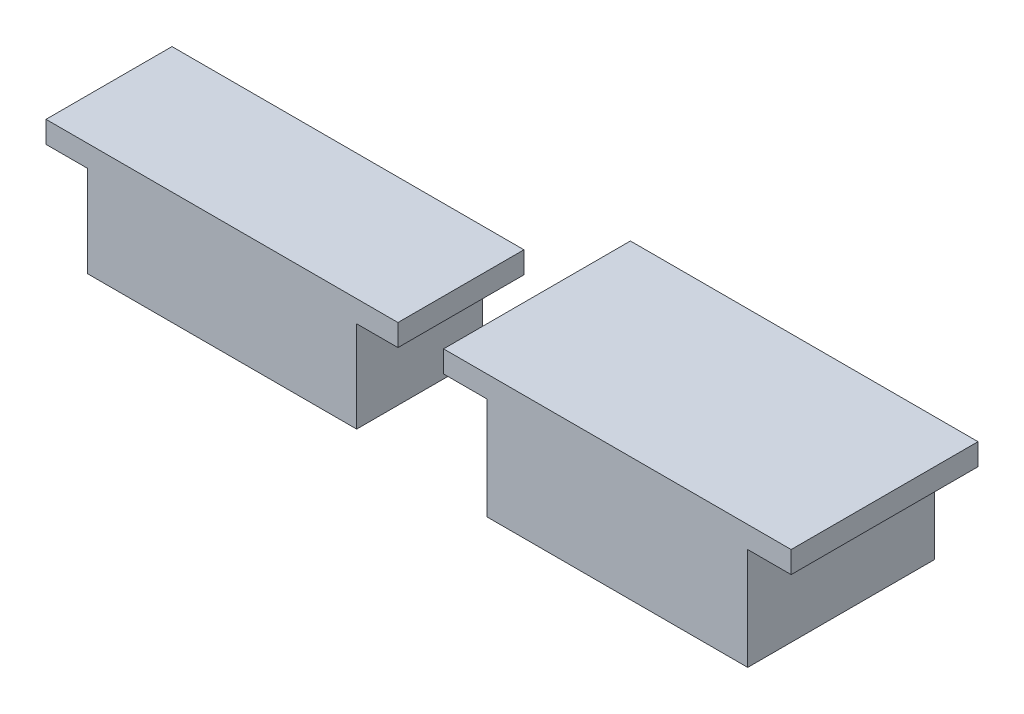
ISO-10303-21;
HEADER;
FILE_DESCRIPTION(('STEP AP214'),'2;1');
FILE_NAME('part.step','',(''),(''),'','','');
FILE_SCHEMA(('AUTOMOTIVE_DESIGN { 1 0 10303 214 1 1 1 1 }'));
ENDSEC;
DATA;
#1=APPLICATION_CONTEXT('core data for automotive mechanical design processes');
#2=APPLICATION_PROTOCOL_DEFINITION('international standard','automotive_design',2000,#1);
#3=PRODUCT_CONTEXT('',#1,'mechanical');
#4=PRODUCT('Part','Part','',(#3));
#5=PRODUCT_RELATED_PRODUCT_CATEGORY('part','',(#4));
#6=PRODUCT_DEFINITION_FORMATION('','',#4);
#7=PRODUCT_DEFINITION_CONTEXT('part definition',#1,'design');
#8=PRODUCT_DEFINITION('design','',#6,#7);
#9=PRODUCT_DEFINITION_SHAPE('','',#8);
#10=(LENGTH_UNIT() NAMED_UNIT(*) SI_UNIT(.MILLI.,.METRE.));
#11=(NAMED_UNIT(*) PLANE_ANGLE_UNIT() SI_UNIT($,.RADIAN.));
#12=(NAMED_UNIT(*) SI_UNIT($,.STERADIAN.) SOLID_ANGLE_UNIT());
#13=UNCERTAINTY_MEASURE_WITH_UNIT(LENGTH_MEASURE(1.E-05),#10,'distance_accuracy_value','');
#14=(GEOMETRIC_REPRESENTATION_CONTEXT(3) GLOBAL_UNCERTAINTY_ASSIGNED_CONTEXT((#13)) GLOBAL_UNIT_ASSIGNED_CONTEXT((#10,
#11,#12)) REPRESENTATION_CONTEXT('',''));
#15=CARTESIAN_POINT('',(0.,0.,0.));
#16=DIRECTION('',(0.,0.,1.));
#17=DIRECTION('',(1.,0.,0.));
#18=AXIS2_PLACEMENT_3D('',#15,#16,#17);
#19=CARTESIAN_POINT('',(-144.,-7.,-34.5));
#20=DIRECTION('',(0.,-1.,0.));
#21=DIRECTION('',(-1.,0.,0.));
#22=AXIS2_PLACEMENT_3D('',#19,#20,#21);
#23=PLANE('',#22);
#24=DIRECTION('',(0.,0.,1.));
#25=VECTOR('',#24,1.);
#26=CARTESIAN_POINT('',(-113.,-7.,-49.));
#27=LINE('',#26,#25);
#28=CARTESIAN_POINT('',(-113.,-7.,-49.));
#29=VERTEX_POINT('',#28);
#30=CARTESIAN_POINT('',(-113.,-7.,-20.));
#31=VERTEX_POINT('',#30);
#32=EDGE_CURVE('E36',#29,#31,#27,.T.);
#33=ORIENTED_EDGE('',*,*,#32,.F.);
#34=DIRECTION('',(1.,0.,0.));
#35=VECTOR('',#34,1.);
#36=CARTESIAN_POINT('',(-184.5,-7.,-49.));
#37=LINE('',#36,#35);
#38=CARTESIAN_POINT('',(-103.5,-7.,-49.));
#39=VERTEX_POINT('',#38);
#40=EDGE_CURVE('E276',#29,#39,#37,.T.);
#41=ORIENTED_EDGE('',*,*,#40,.T.);
#42=DIRECTION('',(0.,0.,1.));
#43=VECTOR('',#42,1.);
#44=CARTESIAN_POINT('',(-103.5,-7.,-49.));
#45=LINE('',#44,#43);
#46=CARTESIAN_POINT('',(-103.5,-7.,-20.));
#47=VERTEX_POINT('',#46);
#48=EDGE_CURVE('E135',#39,#47,#45,.T.);
#49=ORIENTED_EDGE('',*,*,#48,.T.);
#50=DIRECTION('',(-1.,0.,0.));
#51=VECTOR('',#50,1.);
#52=CARTESIAN_POINT('',(-103.5,-7.,-20.));
#53=LINE('',#52,#51);
#54=EDGE_CURVE('E133',#47,#31,#53,.T.);
#55=ORIENTED_EDGE('',*,*,#54,.T.);
#56=EDGE_LOOP('',(#33,#41,#49,#55));
#57=FACE_BOUND('',#56,.T.);
#58=ADVANCED_FACE('F17',(#57),#23,.T.);
#59=CARTESIAN_POINT('',(-103.5,-7.,-20.));
#60=DIRECTION('',(0.,0.,-1.));
#61=DIRECTION('',(-1.,0.,0.));
#62=AXIS2_PLACEMENT_3D('',#59,#60,#61);
#63=PLANE('',#62);
#64=DIRECTION('',(-1.,0.,0.));
#65=VECTOR('',#64,1.);
#66=CARTESIAN_POINT('',(-103.5,-2.,-20.));
#67=LINE('',#66,#65);
#68=CARTESIAN_POINT('',(-103.5,-2.,-20.));
#69=VERTEX_POINT('',#68);
#70=CARTESIAN_POINT('',(-184.5,-2.,-20.));
#71=VERTEX_POINT('',#70);
#72=EDGE_CURVE('E297',#69,#71,#67,.T.);
#73=ORIENTED_EDGE('',*,*,#72,.T.);
#74=DIRECTION('',(0.,1.,0.));
#75=VECTOR('',#74,1.);
#76=CARTESIAN_POINT('',(-184.5,-7.,-20.));
#77=LINE('',#76,#75);
#78=CARTESIAN_POINT('',(-184.5,-7.,-20.));
#79=VERTEX_POINT('',#78);
#80=EDGE_CURVE('E11',#79,#71,#77,.T.);
#81=ORIENTED_EDGE('',*,*,#80,.F.);
#82=CARTESIAN_POINT('',(-175.,-7.,-20.));
#83=VERTEX_POINT('',#82);
#84=EDGE_CURVE('E141',#83,#79,#53,.T.);
#85=ORIENTED_EDGE('',*,*,#84,.F.);
#86=DIRECTION('',(0.,1.,0.));
#87=VECTOR('',#86,1.);
#88=CARTESIAN_POINT('',(-175.,-28.,-20.));
#89=LINE('',#88,#87);
#90=CARTESIAN_POINT('',(-175.,-28.,-20.));
#91=VERTEX_POINT('',#90);
#92=EDGE_CURVE('E303',#91,#83,#89,.T.);
#93=ORIENTED_EDGE('',*,*,#92,.F.);
#94=DIRECTION('',(-1.,0.,0.));
#95=VECTOR('',#94,1.);
#96=CARTESIAN_POINT('',(-113.,-28.,-20.));
#97=LINE('',#96,#95);
#98=CARTESIAN_POINT('',(-113.,-28.,-20.));
#99=VERTEX_POINT('',#98);
#100=EDGE_CURVE('E153',#99,#91,#97,.T.);
#101=ORIENTED_EDGE('',*,*,#100,.F.);
#102=DIRECTION('',(0.,1.,0.));
#103=VECTOR('',#102,1.);
#104=CARTESIAN_POINT('',(-113.,-28.,-20.));
#105=LINE('',#104,#103);
#106=EDGE_CURVE('E148',#99,#31,#105,.T.);
#107=ORIENTED_EDGE('',*,*,#106,.T.);
#108=ORIENTED_EDGE('',*,*,#54,.F.);
#109=DIRECTION('',(0.,1.,0.));
#110=VECTOR('',#109,1.);
#111=CARTESIAN_POINT('',(-103.5,-7.,-20.));
#112=LINE('',#111,#110);
#113=EDGE_CURVE('E304',#47,#69,#112,.T.);
#114=ORIENTED_EDGE('',*,*,#113,.T.);
#115=EDGE_LOOP('',(#73,#81,#85,#93,#101,#107,#108,#114));
#116=FACE_BOUND('',#115,.T.);
#117=ADVANCED_FACE('F157',(#116),#63,.F.);
#118=CARTESIAN_POINT('',(-184.5,-7.,-20.));
#119=DIRECTION('',(1.,0.,0.));
#120=DIRECTION('',(0.,0.,-1.));
#121=AXIS2_PLACEMENT_3D('',#118,#119,#120);
#122=PLANE('',#121);
#123=DIRECTION('',(0.,0.,-1.));
#124=VECTOR('',#123,1.);
#125=CARTESIAN_POINT('',(-184.5,-2.,-20.));
#126=LINE('',#125,#124);
#127=CARTESIAN_POINT('',(-184.5,-2.,-49.));
#128=VERTEX_POINT('',#127);
#129=EDGE_CURVE('E292',#71,#128,#126,.T.);
#130=ORIENTED_EDGE('',*,*,#129,.T.);
#131=DIRECTION('',(0.,1.,0.));
#132=VECTOR('',#131,1.);
#133=CARTESIAN_POINT('',(-184.5,-7.,-49.));
#134=LINE('',#133,#132);
#135=CARTESIAN_POINT('',(-184.5,-7.,-49.));
#136=VERTEX_POINT('',#135);
#137=EDGE_CURVE('E27',#136,#128,#134,.T.);
#138=ORIENTED_EDGE('',*,*,#137,.F.);
#139=DIRECTION('',(0.,0.,-1.));
#140=VECTOR('',#139,1.);
#141=CARTESIAN_POINT('',(-184.5,-7.,-20.));
#142=LINE('',#141,#140);
#143=EDGE_CURVE('E140',#79,#136,#142,.T.);
#144=ORIENTED_EDGE('',*,*,#143,.F.);
#145=ORIENTED_EDGE('',*,*,#80,.T.);
#146=EDGE_LOOP('',(#130,#138,#144,#145));
#147=FACE_BOUND('',#146,.T.);
#148=ADVANCED_FACE('F325',(#147),#122,.F.);
#149=CARTESIAN_POINT('',(-184.5,-7.,-49.));
#150=DIRECTION('',(0.,0.,1.));
#151=DIRECTION('',(1.,0.,0.));
#152=AXIS2_PLACEMENT_3D('',#149,#150,#151);
#153=PLANE('',#152);
#154=DIRECTION('',(1.,0.,0.));
#155=VECTOR('',#154,1.);
#156=CARTESIAN_POINT('',(-184.5,-2.,-49.));
#157=LINE('',#156,#155);
#158=CARTESIAN_POINT('',(-103.5,-2.,-49.));
#159=VERTEX_POINT('',#158);
#160=EDGE_CURVE('E296',#128,#159,#157,.T.);
#161=ORIENTED_EDGE('',*,*,#160,.T.);
#162=DIRECTION('',(0.,1.,0.));
#163=VECTOR('',#162,1.);
#164=CARTESIAN_POINT('',(-103.5,-7.,-49.));
#165=LINE('',#164,#163);
#166=EDGE_CURVE('E306',#39,#159,#165,.T.);
#167=ORIENTED_EDGE('',*,*,#166,.F.);
#168=ORIENTED_EDGE('',*,*,#40,.F.);
#169=DIRECTION('',(0.,1.,0.));
#170=VECTOR('',#169,1.);
#171=CARTESIAN_POINT('',(-113.,-28.,-49.));
#172=LINE('',#171,#170);
#173=CARTESIAN_POINT('',(-113.,-28.,-49.));
#174=VERTEX_POINT('',#173);
#175=EDGE_CURVE('E151',#174,#29,#172,.T.);
#176=ORIENTED_EDGE('',*,*,#175,.F.);
#177=DIRECTION('',(1.,0.,0.));
#178=VECTOR('',#177,1.);
#179=CARTESIAN_POINT('',(-175.,-28.,-49.));
#180=LINE('',#179,#178);
#181=CARTESIAN_POINT('',(-175.,-28.,-49.));
#182=VERTEX_POINT('',#181);
#183=EDGE_CURVE('E165',#182,#174,#180,.T.);
#184=ORIENTED_EDGE('',*,*,#183,.F.);
#185=DIRECTION('',(0.,1.,0.));
#186=VECTOR('',#185,1.);
#187=CARTESIAN_POINT('',(-175.,-28.,-49.));
#188=LINE('',#187,#186);
#189=CARTESIAN_POINT('',(-175.,-7.,-49.));
#190=VERTEX_POINT('',#189);
#191=EDGE_CURVE('E162',#182,#190,#188,.T.);
#192=ORIENTED_EDGE('',*,*,#191,.T.);
#193=EDGE_CURVE('E102',#136,#190,#37,.T.);
#194=ORIENTED_EDGE('',*,*,#193,.F.);
#195=ORIENTED_EDGE('',*,*,#137,.T.);
#196=EDGE_LOOP('',(#161,#167,#168,#176,#184,#192,#194,#195));
#197=FACE_BOUND('',#196,.T.);
#198=ADVANCED_FACE('F313',(#197),#153,.F.);
#199=CARTESIAN_POINT('',(-103.5,-7.,-49.));
#200=DIRECTION('',(-1.,0.,0.));
#201=DIRECTION('',(0.,0.,1.));
#202=AXIS2_PLACEMENT_3D('',#199,#200,#201);
#203=PLANE('',#202);
#204=DIRECTION('',(0.,0.,1.));
#205=VECTOR('',#204,1.);
#206=CARTESIAN_POINT('',(-103.5,-2.,-49.));
#207=LINE('',#206,#205);
#208=EDGE_CURVE('E289',#159,#69,#207,.T.);
#209=ORIENTED_EDGE('',*,*,#208,.T.);
#210=ORIENTED_EDGE('',*,*,#113,.F.);
#211=ORIENTED_EDGE('',*,*,#48,.F.);
#212=ORIENTED_EDGE('',*,*,#166,.T.);
#213=EDGE_LOOP('',(#209,#210,#211,#212));
#214=FACE_BOUND('',#213,.T.);
#215=ADVANCED_FACE('F322',(#214),#203,.F.);
#216=DIRECTION('',(0.,0.,-1.));
#217=VECTOR('',#216,1.);
#218=CARTESIAN_POINT('',(-175.,-7.,-20.));
#219=LINE('',#218,#217);
#220=EDGE_CURVE('E154',#83,#190,#219,.T.);
#221=ORIENTED_EDGE('',*,*,#220,.F.);
#222=ORIENTED_EDGE('',*,*,#84,.T.);
#223=ORIENTED_EDGE('',*,*,#143,.T.);
#224=ORIENTED_EDGE('',*,*,#193,.T.);
#225=EDGE_LOOP('',(#221,#222,#223,#224));
#226=FACE_BOUND('',#225,.T.);
#227=ADVANCED_FACE('F326',(#226),#23,.T.);
#228=CARTESIAN_POINT('',(-144.,-2.,-34.5));
#229=DIRECTION('',(0.,-1.,0.));
#230=DIRECTION('',(-1.,0.,0.));
#231=AXIS2_PLACEMENT_3D('',#228,#229,#230);
#232=PLANE('',#231);
#233=ORIENTED_EDGE('',*,*,#72,.F.);
#234=ORIENTED_EDGE('',*,*,#208,.F.);
#235=ORIENTED_EDGE('',*,*,#160,.F.);
#236=ORIENTED_EDGE('',*,*,#129,.F.);
#237=EDGE_LOOP('',(#233,#234,#235,#236));
#238=FACE_BOUND('',#237,.T.);
#239=ADVANCED_FACE('F320',(#238),#232,.F.);
#240=CARTESIAN_POINT('',(-175.,-28.,-20.));
#241=DIRECTION('',(1.,0.,0.));
#242=DIRECTION('',(0.,0.,-1.));
#243=AXIS2_PLACEMENT_3D('',#240,#241,#242);
#244=PLANE('',#243);
#245=ORIENTED_EDGE('',*,*,#220,.T.);
#246=ORIENTED_EDGE('',*,*,#191,.F.);
#247=DIRECTION('',(0.,0.,-1.));
#248=VECTOR('',#247,1.);
#249=CARTESIAN_POINT('',(-175.,-28.,-20.));
#250=LINE('',#249,#248);
#251=EDGE_CURVE('E743',#91,#182,#250,.T.);
#252=ORIENTED_EDGE('',*,*,#251,.F.);
#253=ORIENTED_EDGE('',*,*,#92,.T.);
#254=EDGE_LOOP('',(#245,#246,#252,#253));
#255=FACE_BOUND('',#254,.T.);
#256=ADVANCED_FACE('F334',(#255),#244,.F.);
#257=CARTESIAN_POINT('',(-113.,-28.,-49.));
#258=DIRECTION('',(-1.,0.,0.));
#259=DIRECTION('',(0.,0.,1.));
#260=AXIS2_PLACEMENT_3D('',#257,#258,#259);
#261=PLANE('',#260);
#262=ORIENTED_EDGE('',*,*,#32,.T.);
#263=ORIENTED_EDGE('',*,*,#106,.F.);
#264=DIRECTION('',(0.,0.,1.));
#265=VECTOR('',#264,1.);
#266=CARTESIAN_POINT('',(-113.,-28.,-49.));
#267=LINE('',#266,#265);
#268=EDGE_CURVE('E160',#174,#99,#267,.T.);
#269=ORIENTED_EDGE('',*,*,#268,.F.);
#270=ORIENTED_EDGE('',*,*,#175,.T.);
#271=EDGE_LOOP('',(#262,#263,#269,#270));
#272=FACE_BOUND('',#271,.T.);
#273=ADVANCED_FACE('F146',(#272),#261,.F.);
#274=CARTESIAN_POINT('',(-144.,-28.,-34.5));
#275=DIRECTION('',(0.,-1.,0.));
#276=DIRECTION('',(-1.,0.,0.));
#277=AXIS2_PLACEMENT_3D('',#274,#275,#276);
#278=PLANE('',#277);
#279=ORIENTED_EDGE('',*,*,#100,.T.);
#280=ORIENTED_EDGE('',*,*,#251,.T.);
#281=ORIENTED_EDGE('',*,*,#183,.T.);
#282=ORIENTED_EDGE('',*,*,#268,.T.);
#283=EDGE_LOOP('',(#279,#280,#281,#282));
#284=FACE_BOUND('',#283,.T.);
#285=ADVANCED_FACE('F443',(#284),#278,.T.);
#286=CLOSED_SHELL('',(#58,#117,#148,#198,#215,#227,#239,#256,#273,#285));
#287=MANIFOLD_SOLID_BREP('B1',#286);
#288=CARTESIAN_POINT('',(-53.,-7.,-41.5));
#289=DIRECTION('',(0.,-1.,0.));
#290=DIRECTION('',(-1.,0.,0.));
#291=AXIS2_PLACEMENT_3D('',#288,#289,#290);
#292=PLANE('',#291);
#293=DIRECTION('',(0.,0.,1.));
#294=VECTOR('',#293,1.);
#295=CARTESIAN_POINT('',(-23.,-7.,-63.));
#296=LINE('',#295,#294);
#297=CARTESIAN_POINT('',(-23.,-7.,-63.));
#298=VERTEX_POINT('',#297);
#299=CARTESIAN_POINT('',(-23.,-7.,-20.));
#300=VERTEX_POINT('',#299);
#301=EDGE_CURVE('E94',#298,#300,#296,.T.);
#302=ORIENTED_EDGE('',*,*,#301,.F.);
#303=DIRECTION('',(1.,0.,0.));
#304=VECTOR('',#303,1.);
#305=CARTESIAN_POINT('',(-93.,-7.,-63.));
#306=LINE('',#305,#304);
#307=CARTESIAN_POINT('',(-13.,-7.,-63.));
#308=VERTEX_POINT('',#307);
#309=EDGE_CURVE('E192',#298,#308,#306,.T.);
#310=ORIENTED_EDGE('',*,*,#309,.T.);
#311=DIRECTION('',(0.,0.,1.));
#312=VECTOR('',#311,1.);
#313=CARTESIAN_POINT('',(-13.,-7.,-63.));
#314=LINE('',#313,#312);
#315=CARTESIAN_POINT('',(-13.,-7.,-20.));
#316=VERTEX_POINT('',#315);
#317=EDGE_CURVE('E227',#308,#316,#314,.T.);
#318=ORIENTED_EDGE('',*,*,#317,.T.);
#319=DIRECTION('',(-1.,0.,0.));
#320=VECTOR('',#319,1.);
#321=CARTESIAN_POINT('',(-13.,-7.,-20.));
#322=LINE('',#321,#320);
#323=EDGE_CURVE('E228',#316,#300,#322,.T.);
#324=ORIENTED_EDGE('',*,*,#323,.T.);
#325=EDGE_LOOP('',(#302,#310,#318,#324));
#326=FACE_BOUND('',#325,.T.);
#327=ADVANCED_FACE('F340',(#326),#292,.T.);
#328=CARTESIAN_POINT('',(-13.,-7.,-20.));
#329=DIRECTION('',(0.,0.,-1.));
#330=DIRECTION('',(-1.,0.,0.));
#331=AXIS2_PLACEMENT_3D('',#328,#329,#330);
#332=PLANE('',#331);
#333=DIRECTION('',(-1.,0.,0.));
#334=VECTOR('',#333,1.);
#335=CARTESIAN_POINT('',(-13.,-2.,-20.));
#336=LINE('',#335,#334);
#337=CARTESIAN_POINT('',(-13.,-2.,-20.));
#338=VERTEX_POINT('',#337);
#339=CARTESIAN_POINT('',(-93.,-2.,-20.));
#340=VERTEX_POINT('',#339);
#341=EDGE_CURVE('E204',#338,#340,#336,.T.);
#342=ORIENTED_EDGE('',*,*,#341,.T.);
#343=DIRECTION('',(0.,1.,0.));
#344=VECTOR('',#343,1.);
#345=CARTESIAN_POINT('',(-93.,-7.,-20.));
#346=LINE('',#345,#344);
#347=CARTESIAN_POINT('',(-93.,-7.,-20.));
#348=VERTEX_POINT('',#347);
#349=EDGE_CURVE('E260',#348,#340,#346,.T.);
#350=ORIENTED_EDGE('',*,*,#349,.F.);
#351=CARTESIAN_POINT('',(-83.,-7.,-20.));
#352=VERTEX_POINT('',#351);
#353=EDGE_CURVE('E231',#352,#348,#322,.T.);
#354=ORIENTED_EDGE('',*,*,#353,.F.);
#355=DIRECTION('',(0.,1.,0.));
#356=VECTOR('',#355,1.);
#357=CARTESIAN_POINT('',(-83.,-30.5,-20.));
#358=LINE('',#357,#356);
#359=CARTESIAN_POINT('',(-83.,-30.5,-20.));
#360=VERTEX_POINT('',#359);
#361=EDGE_CURVE('E198',#360,#352,#358,.T.);
#362=ORIENTED_EDGE('',*,*,#361,.F.);
#363=DIRECTION('',(-1.,0.,0.));
#364=VECTOR('',#363,1.);
#365=CARTESIAN_POINT('',(-23.,-30.5,-20.));
#366=LINE('',#365,#364);
#367=CARTESIAN_POINT('',(-23.,-30.5,-20.));
#368=VERTEX_POINT('',#367);
#369=EDGE_CURVE('E177',#368,#360,#366,.T.);
#370=ORIENTED_EDGE('',*,*,#369,.F.);
#371=DIRECTION('',(0.,1.,0.));
#372=VECTOR('',#371,1.);
#373=CARTESIAN_POINT('',(-23.,-30.5,-20.));
#374=LINE('',#373,#372);
#375=EDGE_CURVE('E181',#368,#300,#374,.T.);
#376=ORIENTED_EDGE('',*,*,#375,.T.);
#377=ORIENTED_EDGE('',*,*,#323,.F.);
#378=DIRECTION('',(0.,1.,0.));
#379=VECTOR('',#378,1.);
#380=CARTESIAN_POINT('',(-13.,-7.,-20.));
#381=LINE('',#380,#379);
#382=EDGE_CURVE('E254',#316,#338,#381,.T.);
#383=ORIENTED_EDGE('',*,*,#382,.T.);
#384=EDGE_LOOP('',(#342,#350,#354,#362,#370,#376,#377,#383));
#385=FACE_BOUND('',#384,.T.);
#386=ADVANCED_FACE('F19',(#385),#332,.F.);
#387=CARTESIAN_POINT('',(-93.,-7.,-20.));
#388=DIRECTION('',(1.,0.,0.));
#389=DIRECTION('',(0.,0.,-1.));
#390=AXIS2_PLACEMENT_3D('',#387,#388,#389);
#391=PLANE('',#390);
#392=DIRECTION('',(0.,0.,-1.));
#393=VECTOR('',#392,1.);
#394=CARTESIAN_POINT('',(-93.,-2.,-20.));
#395=LINE('',#394,#393);
#396=CARTESIAN_POINT('',(-93.,-2.,-63.));
#397=VERTEX_POINT('',#396);
#398=EDGE_CURVE('E242',#340,#397,#395,.T.);
#399=ORIENTED_EDGE('',*,*,#398,.T.);
#400=DIRECTION('',(0.,1.,0.));
#401=VECTOR('',#400,1.);
#402=CARTESIAN_POINT('',(-93.,-7.,-63.));
#403=LINE('',#402,#401);
#404=CARTESIAN_POINT('',(-93.,-7.,-63.));
#405=VERTEX_POINT('',#404);
#406=EDGE_CURVE('E258',#405,#397,#403,.T.);
#407=ORIENTED_EDGE('',*,*,#406,.F.);
#408=DIRECTION('',(0.,0.,-1.));
#409=VECTOR('',#408,1.);
#410=CARTESIAN_POINT('',(-93.,-7.,-20.));
#411=LINE('',#410,#409);
#412=EDGE_CURVE('E226',#348,#405,#411,.T.);
#413=ORIENTED_EDGE('',*,*,#412,.F.);
#414=ORIENTED_EDGE('',*,*,#349,.T.);
#415=EDGE_LOOP('',(#399,#407,#413,#414));
#416=FACE_BOUND('',#415,.T.);
#417=ADVANCED_FACE('F349',(#416),#391,.F.);
#418=CARTESIAN_POINT('',(-93.,-7.,-63.));
#419=DIRECTION('',(0.,0.,1.));
#420=DIRECTION('',(1.,0.,0.));
#421=AXIS2_PLACEMENT_3D('',#418,#419,#420);
#422=PLANE('',#421);
#423=DIRECTION('',(1.,0.,0.));
#424=VECTOR('',#423,1.);
#425=CARTESIAN_POINT('',(-93.,-2.,-63.));
#426=LINE('',#425,#424);
#427=CARTESIAN_POINT('',(-13.,-2.,-63.));
#428=VERTEX_POINT('',#427);
#429=EDGE_CURVE('E246',#397,#428,#426,.T.);
#430=ORIENTED_EDGE('',*,*,#429,.T.);
#431=DIRECTION('',(0.,1.,0.));
#432=VECTOR('',#431,1.);
#433=CARTESIAN_POINT('',(-13.,-7.,-63.));
#434=LINE('',#433,#432);
#435=EDGE_CURVE('E223',#308,#428,#434,.T.);
#436=ORIENTED_EDGE('',*,*,#435,.F.);
#437=ORIENTED_EDGE('',*,*,#309,.F.);
#438=DIRECTION('',(0.,1.,0.));
#439=VECTOR('',#438,1.);
#440=CARTESIAN_POINT('',(-23.,-30.5,-63.));
#441=LINE('',#440,#439);
#442=CARTESIAN_POINT('',(-23.,-30.5,-63.));
#443=VERTEX_POINT('',#442);
#444=EDGE_CURVE('E199',#443,#298,#441,.T.);
#445=ORIENTED_EDGE('',*,*,#444,.F.);
#446=DIRECTION('',(1.,0.,0.));
#447=VECTOR('',#446,1.);
#448=CARTESIAN_POINT('',(-83.,-30.5,-63.));
#449=LINE('',#448,#447);
#450=CARTESIAN_POINT('',(-83.,-30.5,-63.));
#451=VERTEX_POINT('',#450);
#452=EDGE_CURVE('E176',#451,#443,#449,.T.);
#453=ORIENTED_EDGE('',*,*,#452,.F.);
#454=DIRECTION('',(0.,1.,0.));
#455=VECTOR('',#454,1.);
#456=CARTESIAN_POINT('',(-83.,-30.5,-63.));
#457=LINE('',#456,#455);
#458=CARTESIAN_POINT('',(-83.,-7.,-63.));
#459=VERTEX_POINT('',#458);
#460=EDGE_CURVE('E195',#451,#459,#457,.T.);
#461=ORIENTED_EDGE('',*,*,#460,.T.);
#462=EDGE_CURVE('E225',#405,#459,#306,.T.);
#463=ORIENTED_EDGE('',*,*,#462,.F.);
#464=ORIENTED_EDGE('',*,*,#406,.T.);
#465=EDGE_LOOP('',(#430,#436,#437,#445,#453,#461,#463,#464));
#466=FACE_BOUND('',#465,.T.);
#467=ADVANCED_FACE('F220',(#466),#422,.F.);
#468=CARTESIAN_POINT('',(-13.,-7.,-63.));
#469=DIRECTION('',(-1.,0.,0.));
#470=DIRECTION('',(0.,0.,1.));
#471=AXIS2_PLACEMENT_3D('',#468,#469,#470);
#472=PLANE('',#471);
#473=DIRECTION('',(0.,0.,1.));
#474=VECTOR('',#473,1.);
#475=CARTESIAN_POINT('',(-13.,-2.,-63.));
#476=LINE('',#475,#474);
#477=EDGE_CURVE('E238',#428,#338,#476,.T.);
#478=ORIENTED_EDGE('',*,*,#477,.T.);
#479=ORIENTED_EDGE('',*,*,#382,.F.);
#480=ORIENTED_EDGE('',*,*,#317,.F.);
#481=ORIENTED_EDGE('',*,*,#435,.T.);
#482=EDGE_LOOP('',(#478,#479,#480,#481));
#483=FACE_BOUND('',#482,.T.);
#484=ADVANCED_FACE('F356',(#483),#472,.F.);
#485=DIRECTION('',(0.,0.,-1.));
#486=VECTOR('',#485,1.);
#487=CARTESIAN_POINT('',(-83.,-7.,-20.));
#488=LINE('',#487,#486);
#489=EDGE_CURVE('E88',#352,#459,#488,.T.);
#490=ORIENTED_EDGE('',*,*,#489,.F.);
#491=ORIENTED_EDGE('',*,*,#353,.T.);
#492=ORIENTED_EDGE('',*,*,#412,.T.);
#493=ORIENTED_EDGE('',*,*,#462,.T.);
#494=EDGE_LOOP('',(#490,#491,#492,#493));
#495=FACE_BOUND('',#494,.T.);
#496=ADVANCED_FACE('F344',(#495),#292,.T.);
#497=CARTESIAN_POINT('',(-53.,-2.,-41.5));
#498=DIRECTION('',(0.,-1.,0.));
#499=DIRECTION('',(-1.,0.,0.));
#500=AXIS2_PLACEMENT_3D('',#497,#498,#499);
#501=PLANE('',#500);
#502=ORIENTED_EDGE('',*,*,#341,.F.);
#503=ORIENTED_EDGE('',*,*,#477,.F.);
#504=ORIENTED_EDGE('',*,*,#429,.F.);
#505=ORIENTED_EDGE('',*,*,#398,.F.);
#506=EDGE_LOOP('',(#502,#503,#504,#505));
#507=FACE_BOUND('',#506,.T.);
#508=ADVANCED_FACE('F355',(#507),#501,.F.);
#509=CARTESIAN_POINT('',(-83.,-30.5,-20.));
#510=DIRECTION('',(1.,0.,0.));
#511=DIRECTION('',(0.,0.,-1.));
#512=AXIS2_PLACEMENT_3D('',#509,#510,#511);
#513=PLANE('',#512);
#514=ORIENTED_EDGE('',*,*,#489,.T.);
#515=ORIENTED_EDGE('',*,*,#460,.F.);
#516=DIRECTION('',(0.,0.,-1.));
#517=VECTOR('',#516,1.);
#518=CARTESIAN_POINT('',(-83.,-30.5,-20.));
#519=LINE('',#518,#517);
#520=EDGE_CURVE('E174',#360,#451,#519,.T.);
#521=ORIENTED_EDGE('',*,*,#520,.F.);
#522=ORIENTED_EDGE('',*,*,#361,.T.);
#523=EDGE_LOOP('',(#514,#515,#521,#522));
#524=FACE_BOUND('',#523,.T.);
#525=ADVANCED_FACE('F361',(#524),#513,.F.);
#526=CARTESIAN_POINT('',(-23.,-30.5,-63.));
#527=DIRECTION('',(-1.,0.,0.));
#528=DIRECTION('',(0.,0.,1.));
#529=AXIS2_PLACEMENT_3D('',#526,#527,#528);
#530=PLANE('',#529);
#531=ORIENTED_EDGE('',*,*,#301,.T.);
#532=ORIENTED_EDGE('',*,*,#375,.F.);
#533=DIRECTION('',(0.,0.,1.));
#534=VECTOR('',#533,1.);
#535=CARTESIAN_POINT('',(-23.,-30.5,-63.));
#536=LINE('',#535,#534);
#537=EDGE_CURVE('E179',#443,#368,#536,.T.);
#538=ORIENTED_EDGE('',*,*,#537,.F.);
#539=ORIENTED_EDGE('',*,*,#444,.T.);
#540=EDGE_LOOP('',(#531,#532,#538,#539));
#541=FACE_BOUND('',#540,.T.);
#542=ADVANCED_FACE('F216',(#541),#530,.F.);
#543=CARTESIAN_POINT('',(-53.,-30.5,-41.5));
#544=DIRECTION('',(0.,-1.,0.));
#545=DIRECTION('',(-1.,0.,0.));
#546=AXIS2_PLACEMENT_3D('',#543,#544,#545);
#547=PLANE('',#546);
#548=ORIENTED_EDGE('',*,*,#369,.T.);
#549=ORIENTED_EDGE('',*,*,#520,.T.);
#550=ORIENTED_EDGE('',*,*,#452,.T.);
#551=ORIENTED_EDGE('',*,*,#537,.T.);
#552=EDGE_LOOP('',(#548,#549,#550,#551));
#553=FACE_BOUND('',#552,.T.);
#554=ADVANCED_FACE('F381',(#553),#547,.T.);
#555=CLOSED_SHELL('',(#327,#386,#417,#467,#484,#496,#508,#525,#542,#554));
#556=MANIFOLD_SOLID_BREP('B1',#555);
#557=ADVANCED_BREP_SHAPE_REPRESENTATION('',(#18,#287,#556),#14);
#558=SHAPE_DEFINITION_REPRESENTATION(#9,#557);
ENDSEC;
END-ISO-10303-21;
